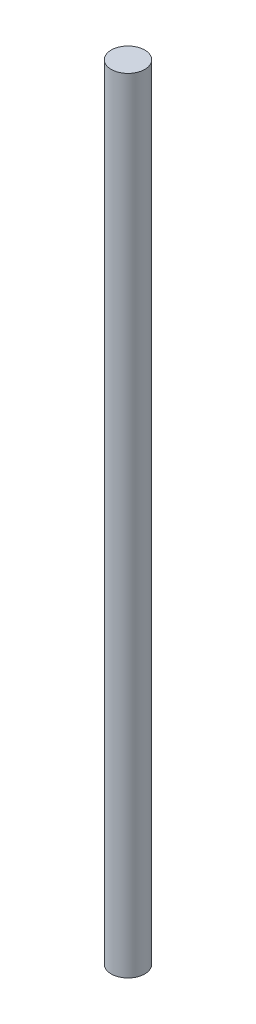
ISO-10303-21;
HEADER;
FILE_DESCRIPTION(('STEP AP214'),'2;1');
FILE_NAME('part.step','',(''),(''),'','','');
FILE_SCHEMA(('AUTOMOTIVE_DESIGN { 1 0 10303 214 1 1 1 1 }'));
ENDSEC;
DATA;
#1=APPLICATION_CONTEXT('core data for automotive mechanical design processes');
#2=APPLICATION_PROTOCOL_DEFINITION('international standard','automotive_design',2000,#1);
#3=PRODUCT_CONTEXT('',#1,'mechanical');
#4=PRODUCT('Part','Part','',(#3));
#5=PRODUCT_RELATED_PRODUCT_CATEGORY('part','',(#4));
#6=PRODUCT_DEFINITION_FORMATION('','',#4);
#7=PRODUCT_DEFINITION_CONTEXT('part definition',#1,'design');
#8=PRODUCT_DEFINITION('design','',#6,#7);
#9=PRODUCT_DEFINITION_SHAPE('','',#8);
#10=(LENGTH_UNIT() NAMED_UNIT(*) SI_UNIT(.MILLI.,.METRE.));
#11=(NAMED_UNIT(*) PLANE_ANGLE_UNIT() SI_UNIT($,.RADIAN.));
#12=(NAMED_UNIT(*) SI_UNIT($,.STERADIAN.) SOLID_ANGLE_UNIT());
#13=UNCERTAINTY_MEASURE_WITH_UNIT(LENGTH_MEASURE(1.E-05),#10,'distance_accuracy_value','');
#14=(GEOMETRIC_REPRESENTATION_CONTEXT(3) GLOBAL_UNCERTAINTY_ASSIGNED_CONTEXT((#13)) GLOBAL_UNIT_ASSIGNED_CONTEXT((#10,
#11,#12)) REPRESENTATION_CONTEXT('',''));
#15=CARTESIAN_POINT('',(0.,0.,0.));
#16=DIRECTION('',(0.,0.,1.));
#17=DIRECTION('',(1.,0.,0.));
#18=AXIS2_PLACEMENT_3D('',#15,#16,#17);
#19=CARTESIAN_POINT('',(0.,88.9,0.));
#20=DIRECTION('',(0.,-1.,0.));
#21=DIRECTION('',(0.,0.,-1.));
#22=AXIS2_PLACEMENT_3D('',#19,#20,#21);
#23=CYLINDRICAL_SURFACE('',#22,1.905);
#24=CARTESIAN_POINT('',(0.,88.9,0.));
#25=DIRECTION('',(0.,1.,0.));
#26=DIRECTION('',(0.,0.,1.));
#27=AXIS2_PLACEMENT_3D('',#24,#25,#26);
#28=CIRCLE('',#27,1.905);
#29=CARTESIAN_POINT('',(0.,88.9,1.905));
#30=VERTEX_POINT('',#29);
#31=EDGE_CURVE('E10',#30,#30,#28,.T.);
#32=ORIENTED_EDGE('',*,*,#31,.F.);
#33=EDGE_LOOP('',(#32));
#34=FACE_BOUND('',#33,.T.);
#35=CARTESIAN_POINT('',(0.,0.,0.));
#36=DIRECTION('',(0.,1.,0.));
#37=DIRECTION('',(0.,0.,1.));
#38=AXIS2_PLACEMENT_3D('',#35,#36,#37);
#39=CIRCLE('',#38,1.905);
#40=CARTESIAN_POINT('',(0.,0.,1.905));
#41=VERTEX_POINT('',#40);
#42=EDGE_CURVE('E37',#41,#41,#39,.T.);
#43=ORIENTED_EDGE('',*,*,#42,.T.);
#44=EDGE_LOOP('',(#43));
#45=FACE_BOUND('',#44,.T.);
#46=ADVANCED_FACE('F34',(#34,#45),#23,.T.);
#47=CARTESIAN_POINT('',(0.,88.9,0.));
#48=DIRECTION('',(0.,1.,0.));
#49=DIRECTION('',(0.,0.,1.));
#50=AXIS2_PLACEMENT_3D('',#47,#48,#49);
#51=PLANE('',#50);
#52=ORIENTED_EDGE('',*,*,#31,.T.);
#53=EDGE_LOOP('',(#52));
#54=FACE_BOUND('',#53,.T.);
#55=ADVANCED_FACE('F49',(#54),#51,.T.);
#56=CARTESIAN_POINT('',(0.,0.,0.));
#57=DIRECTION('',(0.,1.,0.));
#58=DIRECTION('',(0.,0.,1.));
#59=AXIS2_PLACEMENT_3D('',#56,#57,#58);
#60=PLANE('',#59);
#61=ORIENTED_EDGE('',*,*,#42,.F.);
#62=EDGE_LOOP('',(#61));
#63=FACE_BOUND('',#62,.T.);
#64=ADVANCED_FACE('F47',(#63),#60,.F.);
#65=CLOSED_SHELL('',(#46,#55,#64));
#66=MANIFOLD_SOLID_BREP('B2',#65);
#67=ADVANCED_BREP_SHAPE_REPRESENTATION('',(#18,#66),#14);
#68=SHAPE_DEFINITION_REPRESENTATION(#9,#67);
ENDSEC;
END-ISO-10303-21;
